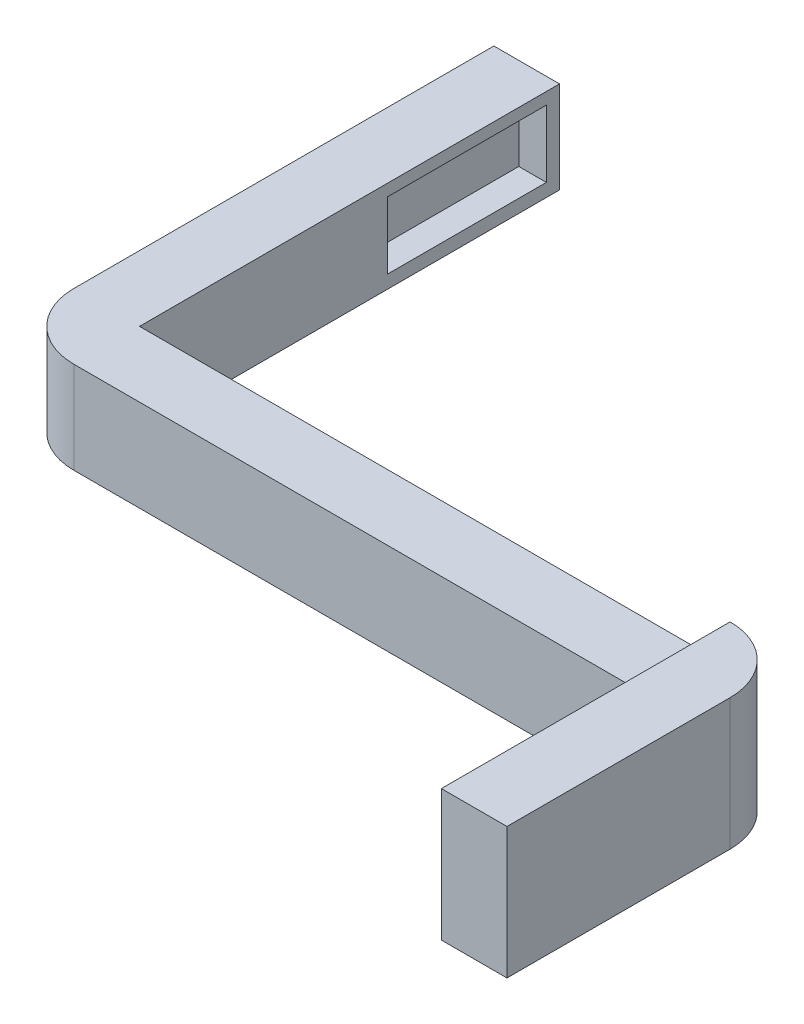
ISO-10303-21;
HEADER;
FILE_DESCRIPTION(('STEP AP214'),'2;1');
FILE_NAME('part.step','',(''),(''),'','','');
FILE_SCHEMA(('AUTOMOTIVE_DESIGN { 1 0 10303 214 1 1 1 1 }'));
ENDSEC;
DATA;
#1=APPLICATION_CONTEXT('core data for automotive mechanical design processes');
#2=APPLICATION_PROTOCOL_DEFINITION('international standard','automotive_design',2000,#1);
#3=PRODUCT_CONTEXT('',#1,'mechanical');
#4=PRODUCT('Part','Part','',(#3));
#5=PRODUCT_RELATED_PRODUCT_CATEGORY('part','',(#4));
#6=PRODUCT_DEFINITION_FORMATION('','',#4);
#7=PRODUCT_DEFINITION_CONTEXT('part definition',#1,'design');
#8=PRODUCT_DEFINITION('design','',#6,#7);
#9=PRODUCT_DEFINITION_SHAPE('','',#8);
#10=(LENGTH_UNIT() NAMED_UNIT(*) SI_UNIT(.MILLI.,.METRE.));
#11=(NAMED_UNIT(*) PLANE_ANGLE_UNIT() SI_UNIT($,.RADIAN.));
#12=(NAMED_UNIT(*) SI_UNIT($,.STERADIAN.) SOLID_ANGLE_UNIT());
#13=UNCERTAINTY_MEASURE_WITH_UNIT(LENGTH_MEASURE(1.E-05),#10,'distance_accuracy_value','');
#14=(GEOMETRIC_REPRESENTATION_CONTEXT(3) GLOBAL_UNCERTAINTY_ASSIGNED_CONTEXT((#13)) GLOBAL_UNIT_ASSIGNED_CONTEXT((#10,
#11,#12)) REPRESENTATION_CONTEXT('',''));
#15=CARTESIAN_POINT('',(0.,0.,0.));
#16=DIRECTION('',(0.,0.,1.));
#17=DIRECTION('',(1.,0.,0.));
#18=AXIS2_PLACEMENT_3D('',#15,#16,#17);
#19=CARTESIAN_POINT('',(22.5,-3.5,5.));
#20=DIRECTION('',(0.,1.,0.));
#21=DIRECTION('',(-1.,0.,0.));
#22=AXIS2_PLACEMENT_3D('',#19,#20,#21);
#23=PLANE('',#22);
#24=DIRECTION('',(1.,0.,0.));
#25=VECTOR('',#24,1.);
#26=CARTESIAN_POINT('',(22.5,-3.5,0.));
#27=LINE('',#26,#25);
#28=CARTESIAN_POINT('',(-22.5,-3.5,0.));
#29=VERTEX_POINT('',#28);
#30=CARTESIAN_POINT('',(22.5,-3.5,0.));
#31=VERTEX_POINT('',#30);
#32=EDGE_CURVE('E275',#29,#31,#27,.T.);
#33=ORIENTED_EDGE('',*,*,#32,.T.);
#34=CARTESIAN_POINT('',(22.5,-3.5,5.));
#35=DIRECTION('',(0.,1.,0.));
#36=DIRECTION('',(-1.,0.,0.));
#37=AXIS2_PLACEMENT_3D('',#34,#35,#36);
#38=CIRCLE('',#37,5.);
#39=CARTESIAN_POINT('',(27.5,-3.5,5.));
#40=VERTEX_POINT('',#39);
#41=EDGE_CURVE('E11',#31,#40,#38,.F.);
#42=ORIENTED_EDGE('',*,*,#41,.T.);
#43=DIRECTION('',(0.,0.,-1.));
#44=VECTOR('',#43,1.);
#45=CARTESIAN_POINT('',(27.5,-3.5,0.));
#46=LINE('',#45,#44);
#47=CARTESIAN_POINT('',(27.5,-3.5,22.));
#48=VERTEX_POINT('',#47);
#49=EDGE_CURVE('E205',#48,#40,#46,.T.);
#50=ORIENTED_EDGE('',*,*,#49,.F.);
#51=DIRECTION('',(-1.,0.,0.));
#52=VECTOR('',#51,1.);
#53=CARTESIAN_POINT('',(27.5,-3.5,22.));
#54=LINE('',#53,#52);
#55=CARTESIAN_POINT('',(22.5,-3.5,22.));
#56=VERTEX_POINT('',#55);
#57=EDGE_CURVE('E209',#48,#56,#54,.T.);
#58=ORIENTED_EDGE('',*,*,#57,.T.);
#59=DIRECTION('',(0.,0.,-1.));
#60=VECTOR('',#59,1.);
#61=CARTESIAN_POINT('',(22.5,-3.5,0.));
#62=LINE('',#61,#60);
#63=CARTESIAN_POINT('',(22.5,-3.5,5.));
#64=VERTEX_POINT('',#63);
#65=EDGE_CURVE('E202',#56,#64,#62,.T.);
#66=ORIENTED_EDGE('',*,*,#65,.T.);
#67=DIRECTION('',(1.,0.,0.));
#68=VECTOR('',#67,1.);
#69=CARTESIAN_POINT('',(22.5,-3.5,5.));
#70=LINE('',#69,#68);
#71=CARTESIAN_POINT('',(-22.5,-3.5,5.));
#72=VERTEX_POINT('',#71);
#73=EDGE_CURVE('E258',#72,#64,#70,.T.);
#74=ORIENTED_EDGE('',*,*,#73,.F.);
#75=CARTESIAN_POINT('',(-22.5,-3.5,0.));
#76=DIRECTION('',(0.,1.,0.));
#77=DIRECTION('',(-1.,0.,0.));
#78=AXIS2_PLACEMENT_3D('',#75,#76,#77);
#79=CIRCLE('',#78,5.);
#80=CARTESIAN_POINT('',(-27.5,-3.5,0.));
#81=VERTEX_POINT('',#80);
#82=EDGE_CURVE('E293',#72,#81,#79,.F.);
#83=ORIENTED_EDGE('',*,*,#82,.T.);
#84=DIRECTION('',(0.,0.,1.));
#85=VECTOR('',#84,1.);
#86=CARTESIAN_POINT('',(-27.5,-3.5,5.));
#87=LINE('',#86,#85);
#88=CARTESIAN_POINT('',(-27.5,-3.50000000000001,-32.));
#89=VERTEX_POINT('',#88);
#90=EDGE_CURVE('E237',#89,#81,#87,.T.);
#91=ORIENTED_EDGE('',*,*,#90,.F.);
#92=DIRECTION('',(1.,0.,0.));
#93=VECTOR('',#92,1.);
#94=CARTESIAN_POINT('',(-27.5,-3.50000000000001,-32.));
#95=LINE('',#94,#93);
#96=CARTESIAN_POINT('',(-22.5,-3.50000000000001,-32.));
#97=VERTEX_POINT('',#96);
#98=EDGE_CURVE('E241',#89,#97,#95,.T.);
#99=ORIENTED_EDGE('',*,*,#98,.T.);
#100=DIRECTION('',(0.,0.,1.));
#101=VECTOR('',#100,1.);
#102=CARTESIAN_POINT('',(-22.5,-3.5,5.));
#103=LINE('',#102,#101);
#104=EDGE_CURVE('E234',#97,#29,#103,.T.);
#105=ORIENTED_EDGE('',*,*,#104,.T.);
#106=EDGE_LOOP('',(#33,#42,#50,#58,#66,#74,#83,#91,#99,#105));
#107=FACE_BOUND('',#106,.T.);
#108=ADVANCED_FACE('F43',(#107),#23,.F.);
#109=CARTESIAN_POINT('',(22.5,3.5,5.));
#110=DIRECTION('',(0.,-1.,0.));
#111=DIRECTION('',(1.,0.,0.));
#112=AXIS2_PLACEMENT_3D('',#109,#110,#111);
#113=PLANE('',#112);
#114=DIRECTION('',(0.,0.,-1.));
#115=VECTOR('',#114,1.);
#116=CARTESIAN_POINT('',(-27.5,3.5,5.));
#117=LINE('',#116,#115);
#118=CARTESIAN_POINT('',(-27.5,3.5,0.));
#119=VERTEX_POINT('',#118);
#120=CARTESIAN_POINT('',(-27.5,3.49999999999999,-32.));
#121=VERTEX_POINT('',#120);
#122=EDGE_CURVE('E230',#119,#121,#117,.T.);
#123=ORIENTED_EDGE('',*,*,#122,.F.);
#124=CARTESIAN_POINT('',(-22.5,3.5,0.));
#125=DIRECTION('',(0.,-1.,0.));
#126=DIRECTION('',(1.,0.,0.));
#127=AXIS2_PLACEMENT_3D('',#124,#125,#126);
#128=CIRCLE('',#127,5.);
#129=CARTESIAN_POINT('',(-22.5,3.5,5.));
#130=VERTEX_POINT('',#129);
#131=EDGE_CURVE('E287',#119,#130,#128,.F.);
#132=ORIENTED_EDGE('',*,*,#131,.T.);
#133=DIRECTION('',(-1.,0.,0.));
#134=VECTOR('',#133,1.);
#135=CARTESIAN_POINT('',(22.5,3.5,5.));
#136=LINE('',#135,#134);
#137=CARTESIAN_POINT('',(22.5,3.5,5.));
#138=VERTEX_POINT('',#137);
#139=EDGE_CURVE('E267',#138,#130,#136,.T.);
#140=ORIENTED_EDGE('',*,*,#139,.F.);
#141=DIRECTION('',(0.,0.,-1.));
#142=VECTOR('',#141,1.);
#143=CARTESIAN_POINT('',(22.5,3.5,5.));
#144=LINE('',#143,#142);
#145=CARTESIAN_POINT('',(22.5,3.5,0.));
#146=VERTEX_POINT('',#145);
#147=EDGE_CURVE('E271',#138,#146,#144,.T.);
#148=ORIENTED_EDGE('',*,*,#147,.T.);
#149=DIRECTION('',(-1.,0.,0.));
#150=VECTOR('',#149,1.);
#151=CARTESIAN_POINT('',(22.5,3.5,0.));
#152=LINE('',#151,#150);
#153=CARTESIAN_POINT('',(-22.5,3.5,0.));
#154=VERTEX_POINT('',#153);
#155=EDGE_CURVE('E263',#146,#154,#152,.T.);
#156=ORIENTED_EDGE('',*,*,#155,.T.);
#157=DIRECTION('',(0.,0.,-1.));
#158=VECTOR('',#157,1.);
#159=CARTESIAN_POINT('',(-22.5,3.5,5.));
#160=LINE('',#159,#158);
#161=CARTESIAN_POINT('',(-22.5,3.49999999999999,-32.));
#162=VERTEX_POINT('',#161);
#163=EDGE_CURVE('E229',#154,#162,#160,.T.);
#164=ORIENTED_EDGE('',*,*,#163,.T.);
#165=DIRECTION('',(1.,0.,0.));
#166=VECTOR('',#165,1.);
#167=CARTESIAN_POINT('',(-27.5,3.49999999999999,-32.));
#168=LINE('',#167,#166);
#169=EDGE_CURVE('E253',#121,#162,#168,.T.);
#170=ORIENTED_EDGE('',*,*,#169,.F.);
#171=EDGE_LOOP('',(#123,#132,#140,#148,#156,#164,#170));
#172=FACE_BOUND('',#171,.T.);
#173=ADVANCED_FACE('F330',(#172),#113,.F.);
#174=CARTESIAN_POINT('',(0.,0.,5.));
#175=DIRECTION('',(0.,0.,-1.));
#176=DIRECTION('',(-1.,0.,0.));
#177=AXIS2_PLACEMENT_3D('',#174,#175,#176);
#178=PLANE('',#177);
#179=ORIENTED_EDGE('',*,*,#139,.T.);
#180=DIRECTION('',(0.,1.,0.));
#181=VECTOR('',#180,1.);
#182=CARTESIAN_POINT('',(-22.5,0.,5.));
#183=LINE('',#182,#181);
#184=EDGE_CURVE('E290',#130,#72,#183,.F.);
#185=ORIENTED_EDGE('',*,*,#184,.T.);
#186=ORIENTED_EDGE('',*,*,#73,.T.);
#187=DIRECTION('',(0.,1.,0.));
#188=VECTOR('',#187,1.);
#189=CARTESIAN_POINT('',(22.5,3.5,5.));
#190=LINE('',#189,#188);
#191=EDGE_CURVE('E262',#64,#138,#190,.T.);
#192=ORIENTED_EDGE('',*,*,#191,.T.);
#193=EDGE_LOOP('',(#179,#185,#186,#192));
#194=FACE_BOUND('',#193,.T.);
#195=ADVANCED_FACE('F326',(#194),#178,.F.);
#196=CARTESIAN_POINT('',(0.,0.,0.));
#197=DIRECTION('',(0.,0.,-1.));
#198=DIRECTION('',(-1.,0.,0.));
#199=AXIS2_PLACEMENT_3D('',#196,#197,#198);
#200=PLANE('',#199);
#201=ORIENTED_EDGE('',*,*,#155,.F.);
#202=DIRECTION('',(0.,1.,0.));
#203=VECTOR('',#202,1.);
#204=CARTESIAN_POINT('',(22.5,-3.5,0.));
#205=LINE('',#204,#203);
#206=EDGE_CURVE('E52',#146,#31,#205,.F.);
#207=ORIENTED_EDGE('',*,*,#206,.T.);
#208=ORIENTED_EDGE('',*,*,#32,.F.);
#209=DIRECTION('',(0.,-1.,0.));
#210=VECTOR('',#209,1.);
#211=CARTESIAN_POINT('',(-22.5,3.5,0.));
#212=LINE('',#211,#210);
#213=EDGE_CURVE('E257',#154,#29,#212,.T.);
#214=ORIENTED_EDGE('',*,*,#213,.F.);
#215=EDGE_LOOP('',(#201,#207,#208,#214));
#216=FACE_BOUND('',#215,.T.);
#217=ADVANCED_FACE('F348',(#216),#200,.T.);
#218=CARTESIAN_POINT('',(-27.5,3.49999999999999,-32.));
#219=DIRECTION('',(0.,0.,1.));
#220=DIRECTION('',(1.,0.,0.));
#221=AXIS2_PLACEMENT_3D('',#218,#219,#220);
#222=PLANE('',#221);
#223=DIRECTION('',(0.,-1.,0.));
#224=VECTOR('',#223,1.);
#225=CARTESIAN_POINT('',(-22.5,3.49999999999999,-32.));
#226=LINE('',#225,#224);
#227=EDGE_CURVE('E244',#162,#97,#226,.T.);
#228=ORIENTED_EDGE('',*,*,#227,.T.);
#229=ORIENTED_EDGE('',*,*,#98,.F.);
#230=DIRECTION('',(0.,-1.,0.));
#231=VECTOR('',#230,1.);
#232=CARTESIAN_POINT('',(-27.5,3.49999999999999,-32.));
#233=LINE('',#232,#231);
#234=EDGE_CURVE('E233',#121,#89,#233,.T.);
#235=ORIENTED_EDGE('',*,*,#234,.F.);
#236=ORIENTED_EDGE('',*,*,#169,.T.);
#237=EDGE_LOOP('',(#228,#229,#235,#236));
#238=FACE_BOUND('',#237,.T.);
#239=ADVANCED_FACE('F349',(#238),#222,.F.);
#240=CARTESIAN_POINT('',(-27.5,0.,0.));
#241=DIRECTION('',(1.,0.,0.));
#242=DIRECTION('',(0.,0.,-1.));
#243=AXIS2_PLACEMENT_3D('',#240,#241,#242);
#244=PLANE('',#243);
#245=ORIENTED_EDGE('',*,*,#90,.T.);
#246=DIRECTION('',(0.,1.,0.));
#247=VECTOR('',#246,1.);
#248=CARTESIAN_POINT('',(-27.5,0.,0.));
#249=LINE('',#248,#247);
#250=EDGE_CURVE('E283',#81,#119,#249,.T.);
#251=ORIENTED_EDGE('',*,*,#250,.T.);
#252=ORIENTED_EDGE('',*,*,#122,.T.);
#253=ORIENTED_EDGE('',*,*,#234,.T.);
#254=EDGE_LOOP('',(#245,#251,#252,#253));
#255=FACE_BOUND('',#254,.T.);
#256=ADVANCED_FACE('F337',(#255),#244,.F.);
#257=CARTESIAN_POINT('',(-22.5,0.,0.));
#258=DIRECTION('',(1.,0.,0.));
#259=DIRECTION('',(0.,0.,-1.));
#260=AXIS2_PLACEMENT_3D('',#257,#258,#259);
#261=PLANE('',#260);
#262=DIRECTION('',(0.,-1.,0.));
#263=VECTOR('',#262,1.);
#264=CARTESIAN_POINT('',(-22.5,2.59999999999999,-18.9));
#265=LINE('',#264,#263);
#266=CARTESIAN_POINT('',(-22.5,2.59999999999999,-18.9));
#267=VERTEX_POINT('',#266);
#268=CARTESIAN_POINT('',(-22.5,-2.50000000000001,-18.9));
#269=VERTEX_POINT('',#268);
#270=EDGE_CURVE('E59',#267,#269,#265,.T.);
#271=ORIENTED_EDGE('',*,*,#270,.F.);
#272=DIRECTION('',(0.,0.,1.));
#273=VECTOR('',#272,1.);
#274=CARTESIAN_POINT('',(-22.5,2.59999999999999,-31.));
#275=LINE('',#274,#273);
#276=CARTESIAN_POINT('',(-22.5,2.59999999999999,-31.));
#277=VERTEX_POINT('',#276);
#278=EDGE_CURVE('E170',#277,#267,#275,.T.);
#279=ORIENTED_EDGE('',*,*,#278,.F.);
#280=DIRECTION('',(0.,1.,0.));
#281=VECTOR('',#280,1.);
#282=CARTESIAN_POINT('',(-22.5,2.59999999999999,-31.));
#283=LINE('',#282,#281);
#284=CARTESIAN_POINT('',(-22.5,-2.50000000000001,-31.));
#285=VERTEX_POINT('',#284);
#286=EDGE_CURVE('E174',#285,#277,#283,.T.);
#287=ORIENTED_EDGE('',*,*,#286,.F.);
#288=DIRECTION('',(0.,0.,-1.));
#289=VECTOR('',#288,1.);
#290=CARTESIAN_POINT('',(-22.5,-2.50000000000001,-31.));
#291=LINE('',#290,#289);
#292=EDGE_CURVE('E183',#269,#285,#291,.T.);
#293=ORIENTED_EDGE('',*,*,#292,.F.);
#294=EDGE_LOOP('',(#271,#279,#287,#293));
#295=FACE_BOUND('',#294,.T.);
#296=ORIENTED_EDGE('',*,*,#163,.F.);
#297=ORIENTED_EDGE('',*,*,#213,.T.);
#298=ORIENTED_EDGE('',*,*,#104,.F.);
#299=ORIENTED_EDGE('',*,*,#227,.F.);
#300=EDGE_LOOP('',(#296,#297,#298,#299));
#301=FACE_BOUND('',#300,.T.);
#302=ADVANCED_FACE('F346',(#295,#301),#261,.T.);
#303=CARTESIAN_POINT('',(-22.5,0.,0.));
#304=DIRECTION('',(0.,1.,0.));
#305=DIRECTION('',(0.,0.,1.));
#306=AXIS2_PLACEMENT_3D('',#303,#304,#305);
#307=CYLINDRICAL_SURFACE('',#306,5.);
#308=ORIENTED_EDGE('',*,*,#82,.F.);
#309=ORIENTED_EDGE('',*,*,#184,.F.);
#310=ORIENTED_EDGE('',*,*,#131,.F.);
#311=ORIENTED_EDGE('',*,*,#250,.F.);
#312=EDGE_LOOP('',(#308,#309,#310,#311));
#313=FACE_BOUND('',#312,.T.);
#314=ADVANCED_FACE('F335',(#313),#307,.T.);
#315=CARTESIAN_POINT('',(22.5,0.,0.));
#316=DIRECTION('',(-1.,0.,0.));
#317=DIRECTION('',(0.,0.,1.));
#318=AXIS2_PLACEMENT_3D('',#315,#316,#317);
#319=PLANE('',#318);
#320=ORIENTED_EDGE('',*,*,#147,.F.);
#321=ORIENTED_EDGE('',*,*,#191,.F.);
#322=ORIENTED_EDGE('',*,*,#65,.F.);
#323=DIRECTION('',(0.,-1.,0.));
#324=VECTOR('',#323,1.);
#325=CARTESIAN_POINT('',(22.5,6.5,22.));
#326=LINE('',#325,#324);
#327=CARTESIAN_POINT('',(22.5,6.5,22.));
#328=VERTEX_POINT('',#327);
#329=EDGE_CURVE('E216',#328,#56,#326,.T.);
#330=ORIENTED_EDGE('',*,*,#329,.F.);
#331=DIRECTION('',(0.,0.,1.));
#332=VECTOR('',#331,1.);
#333=CARTESIAN_POINT('',(22.5,6.5,0.));
#334=LINE('',#333,#332);
#335=CARTESIAN_POINT('',(22.5,6.5,0.));
#336=VERTEX_POINT('',#335);
#337=EDGE_CURVE('E213',#336,#328,#334,.T.);
#338=ORIENTED_EDGE('',*,*,#337,.F.);
#339=DIRECTION('',(0.,1.,0.));
#340=VECTOR('',#339,1.);
#341=CARTESIAN_POINT('',(22.5,6.5,0.));
#342=LINE('',#341,#340);
#343=EDGE_CURVE('E192',#146,#336,#342,.T.);
#344=ORIENTED_EDGE('',*,*,#343,.F.);
#345=EDGE_LOOP('',(#320,#321,#322,#330,#338,#344));
#346=FACE_BOUND('',#345,.T.);
#347=ADVANCED_FACE('F312',(#346),#319,.T.);
#348=CARTESIAN_POINT('',(27.5,6.5,0.));
#349=DIRECTION('',(0.,-1.,0.));
#350=DIRECTION('',(0.,0.,-1.));
#351=AXIS2_PLACEMENT_3D('',#348,#349,#350);
#352=PLANE('',#351);
#353=DIRECTION('',(0.,0.,1.));
#354=VECTOR('',#353,1.);
#355=CARTESIAN_POINT('',(27.5,6.5,0.));
#356=LINE('',#355,#354);
#357=CARTESIAN_POINT('',(27.5,6.5,5.));
#358=VERTEX_POINT('',#357);
#359=CARTESIAN_POINT('',(27.5,6.5,22.));
#360=VERTEX_POINT('',#359);
#361=EDGE_CURVE('E198',#358,#360,#356,.T.);
#362=ORIENTED_EDGE('',*,*,#361,.F.);
#363=CARTESIAN_POINT('',(22.5,6.5,5.));
#364=DIRECTION('',(0.,-1.,0.));
#365=DIRECTION('',(0.,0.,-1.));
#366=AXIS2_PLACEMENT_3D('',#363,#364,#365);
#367=CIRCLE('',#366,5.);
#368=EDGE_CURVE('E300',#358,#336,#367,.F.);
#369=ORIENTED_EDGE('',*,*,#368,.T.);
#370=ORIENTED_EDGE('',*,*,#337,.T.);
#371=DIRECTION('',(-1.,0.,0.));
#372=VECTOR('',#371,1.);
#373=CARTESIAN_POINT('',(27.5,6.5,22.));
#374=LINE('',#373,#372);
#375=EDGE_CURVE('E225',#360,#328,#374,.T.);
#376=ORIENTED_EDGE('',*,*,#375,.F.);
#377=EDGE_LOOP('',(#362,#369,#370,#376));
#378=FACE_BOUND('',#377,.T.);
#379=ADVANCED_FACE('F306',(#378),#352,.F.);
#380=CARTESIAN_POINT('',(27.5,6.5,22.));
#381=DIRECTION('',(0.,0.,-1.));
#382=DIRECTION('',(-1.,0.,0.));
#383=AXIS2_PLACEMENT_3D('',#380,#381,#382);
#384=PLANE('',#383);
#385=ORIENTED_EDGE('',*,*,#329,.T.);
#386=ORIENTED_EDGE('',*,*,#57,.F.);
#387=DIRECTION('',(0.,-1.,0.));
#388=VECTOR('',#387,1.);
#389=CARTESIAN_POINT('',(27.5,6.5,22.));
#390=LINE('',#389,#388);
#391=EDGE_CURVE('E201',#360,#48,#390,.T.);
#392=ORIENTED_EDGE('',*,*,#391,.F.);
#393=ORIENTED_EDGE('',*,*,#375,.T.);
#394=EDGE_LOOP('',(#385,#386,#392,#393));
#395=FACE_BOUND('',#394,.T.);
#396=ADVANCED_FACE('F322',(#395),#384,.F.);
#397=CARTESIAN_POINT('',(27.5,0.,0.));
#398=DIRECTION('',(-1.,0.,0.));
#399=DIRECTION('',(0.,0.,1.));
#400=AXIS2_PLACEMENT_3D('',#397,#398,#399);
#401=PLANE('',#400);
#402=ORIENTED_EDGE('',*,*,#49,.T.);
#403=DIRECTION('',(0.,1.,0.));
#404=VECTOR('',#403,1.);
#405=CARTESIAN_POINT('',(27.5,6.5,5.));
#406=LINE('',#405,#404);
#407=EDGE_CURVE('E296',#40,#358,#406,.T.);
#408=ORIENTED_EDGE('',*,*,#407,.T.);
#409=ORIENTED_EDGE('',*,*,#361,.T.);
#410=ORIENTED_EDGE('',*,*,#391,.T.);
#411=EDGE_LOOP('',(#402,#408,#409,#410));
#412=FACE_BOUND('',#411,.T.);
#413=ADVANCED_FACE('F318',(#412),#401,.F.);
#414=CARTESIAN_POINT('',(22.5,0.,5.));
#415=DIRECTION('',(0.,-1.,0.));
#416=DIRECTION('',(0.,0.,-1.));
#417=AXIS2_PLACEMENT_3D('',#414,#415,#416);
#418=CYLINDRICAL_SURFACE('',#417,5.);
#419=ORIENTED_EDGE('',*,*,#206,.F.);
#420=ORIENTED_EDGE('',*,*,#343,.T.);
#421=ORIENTED_EDGE('',*,*,#368,.F.);
#422=ORIENTED_EDGE('',*,*,#407,.F.);
#423=ORIENTED_EDGE('',*,*,#41,.F.);
#424=EDGE_LOOP('',(#419,#420,#421,#422,#423));
#425=FACE_BOUND('',#424,.T.);
#426=ADVANCED_FACE('F45',(#425),#418,.T.);
#427=CARTESIAN_POINT('',(-24.6,2.59999999999999,-18.9));
#428=DIRECTION('',(0.,0.,1.));
#429=DIRECTION('',(1.,0.,0.));
#430=AXIS2_PLACEMENT_3D('',#427,#428,#429);
#431=PLANE('',#430);
#432=ORIENTED_EDGE('',*,*,#270,.T.);
#433=DIRECTION('',(1.,0.,0.));
#434=VECTOR('',#433,1.);
#435=CARTESIAN_POINT('',(-24.6,-2.50000000000001,-18.9));
#436=LINE('',#435,#434);
#437=CARTESIAN_POINT('',(-24.6,-2.50000000000001,-18.9));
#438=VERTEX_POINT('',#437);
#439=EDGE_CURVE('E145',#438,#269,#436,.T.);
#440=ORIENTED_EDGE('',*,*,#439,.F.);
#441=DIRECTION('',(0.,-1.,0.));
#442=VECTOR('',#441,1.);
#443=CARTESIAN_POINT('',(-24.6,2.59999999999999,-18.9));
#444=LINE('',#443,#442);
#445=CARTESIAN_POINT('',(-24.6,2.59999999999999,-18.9));
#446=VERTEX_POINT('',#445);
#447=EDGE_CURVE('E149',#446,#438,#444,.T.);
#448=ORIENTED_EDGE('',*,*,#447,.F.);
#449=DIRECTION('',(1.,0.,0.));
#450=VECTOR('',#449,1.);
#451=CARTESIAN_POINT('',(-24.6,2.59999999999999,-18.9));
#452=LINE('',#451,#450);
#453=EDGE_CURVE('E189',#446,#267,#452,.T.);
#454=ORIENTED_EDGE('',*,*,#453,.T.);
#455=EDGE_LOOP('',(#432,#440,#448,#454));
#456=FACE_BOUND('',#455,.T.);
#457=ADVANCED_FACE('F147',(#456),#431,.F.);
#458=CARTESIAN_POINT('',(-24.6,2.59999999999999,-31.));
#459=DIRECTION('',(0.,1.,0.));
#460=DIRECTION('',(0.,0.,1.));
#461=AXIS2_PLACEMENT_3D('',#458,#459,#460);
#462=PLANE('',#461);
#463=ORIENTED_EDGE('',*,*,#278,.T.);
#464=ORIENTED_EDGE('',*,*,#453,.F.);
#465=DIRECTION('',(0.,0.,1.));
#466=VECTOR('',#465,1.);
#467=CARTESIAN_POINT('',(-24.6,2.59999999999999,-31.));
#468=LINE('',#467,#466);
#469=CARTESIAN_POINT('',(-24.6,2.59999999999999,-31.));
#470=VERTEX_POINT('',#469);
#471=EDGE_CURVE('E156',#470,#446,#468,.T.);
#472=ORIENTED_EDGE('',*,*,#471,.F.);
#473=DIRECTION('',(1.,0.,0.));
#474=VECTOR('',#473,1.);
#475=CARTESIAN_POINT('',(-24.6,2.59999999999999,-31.));
#476=LINE('',#475,#474);
#477=EDGE_CURVE('E193',#470,#277,#476,.T.);
#478=ORIENTED_EDGE('',*,*,#477,.T.);
#479=EDGE_LOOP('',(#463,#464,#472,#478));
#480=FACE_BOUND('',#479,.T.);
#481=ADVANCED_FACE('F384',(#480),#462,.F.);
#482=CARTESIAN_POINT('',(-24.6,2.59999999999999,-31.));
#483=DIRECTION('',(0.,0.,-1.));
#484=DIRECTION('',(0.,1.,0.));
#485=AXIS2_PLACEMENT_3D('',#482,#483,#484);
#486=PLANE('',#485);
#487=ORIENTED_EDGE('',*,*,#286,.T.);
#488=ORIENTED_EDGE('',*,*,#477,.F.);
#489=DIRECTION('',(0.,1.,0.));
#490=VECTOR('',#489,1.);
#491=CARTESIAN_POINT('',(-24.6,2.59999999999999,-31.));
#492=LINE('',#491,#490);
#493=CARTESIAN_POINT('',(-24.6,-2.50000000000001,-31.));
#494=VERTEX_POINT('',#493);
#495=EDGE_CURVE('E165',#494,#470,#492,.T.);
#496=ORIENTED_EDGE('',*,*,#495,.F.);
#497=DIRECTION('',(1.,0.,0.));
#498=VECTOR('',#497,1.);
#499=CARTESIAN_POINT('',(-24.6,-2.50000000000001,-31.));
#500=LINE('',#499,#498);
#501=EDGE_CURVE('E155',#494,#285,#500,.T.);
#502=ORIENTED_EDGE('',*,*,#501,.T.);
#503=EDGE_LOOP('',(#487,#488,#496,#502));
#504=FACE_BOUND('',#503,.T.);
#505=ADVANCED_FACE('F387',(#504),#486,.F.);
#506=CARTESIAN_POINT('',(-24.6,-2.50000000000001,-31.));
#507=DIRECTION('',(0.,-1.,0.));
#508=DIRECTION('',(0.,0.,-1.));
#509=AXIS2_PLACEMENT_3D('',#506,#507,#508);
#510=PLANE('',#509);
#511=ORIENTED_EDGE('',*,*,#292,.T.);
#512=ORIENTED_EDGE('',*,*,#501,.F.);
#513=DIRECTION('',(0.,0.,-1.));
#514=VECTOR('',#513,1.);
#515=CARTESIAN_POINT('',(-24.6,-2.50000000000001,-31.));
#516=LINE('',#515,#514);
#517=EDGE_CURVE('E159',#438,#494,#516,.T.);
#518=ORIENTED_EDGE('',*,*,#517,.F.);
#519=ORIENTED_EDGE('',*,*,#439,.T.);
#520=EDGE_LOOP('',(#511,#512,#518,#519));
#521=FACE_BOUND('',#520,.T.);
#522=ADVANCED_FACE('F160',(#521),#510,.F.);
#523=CARTESIAN_POINT('',(-24.6,0.,0.));
#524=DIRECTION('',(-1.,0.,0.));
#525=DIRECTION('',(0.,0.,1.));
#526=AXIS2_PLACEMENT_3D('',#523,#524,#525);
#527=PLANE('',#526);
#528=ORIENTED_EDGE('',*,*,#447,.T.);
#529=ORIENTED_EDGE('',*,*,#517,.T.);
#530=ORIENTED_EDGE('',*,*,#495,.T.);
#531=ORIENTED_EDGE('',*,*,#471,.T.);
#532=EDGE_LOOP('',(#528,#529,#530,#531));
#533=FACE_BOUND('',#532,.T.);
#534=ADVANCED_FACE('F167',(#533),#527,.F.);
#535=CLOSED_SHELL('',(#108,#173,#195,#217,#239,#256,#302,#314,#347,#379,#396,#413,#426,#457,
#481,#505,#522,#534));
#536=MANIFOLD_SOLID_BREP('B2',#535);
#537=ADVANCED_BREP_SHAPE_REPRESENTATION('',(#18,#536),#14);
#538=SHAPE_DEFINITION_REPRESENTATION(#9,#537);
ENDSEC;
END-ISO-10303-21;
